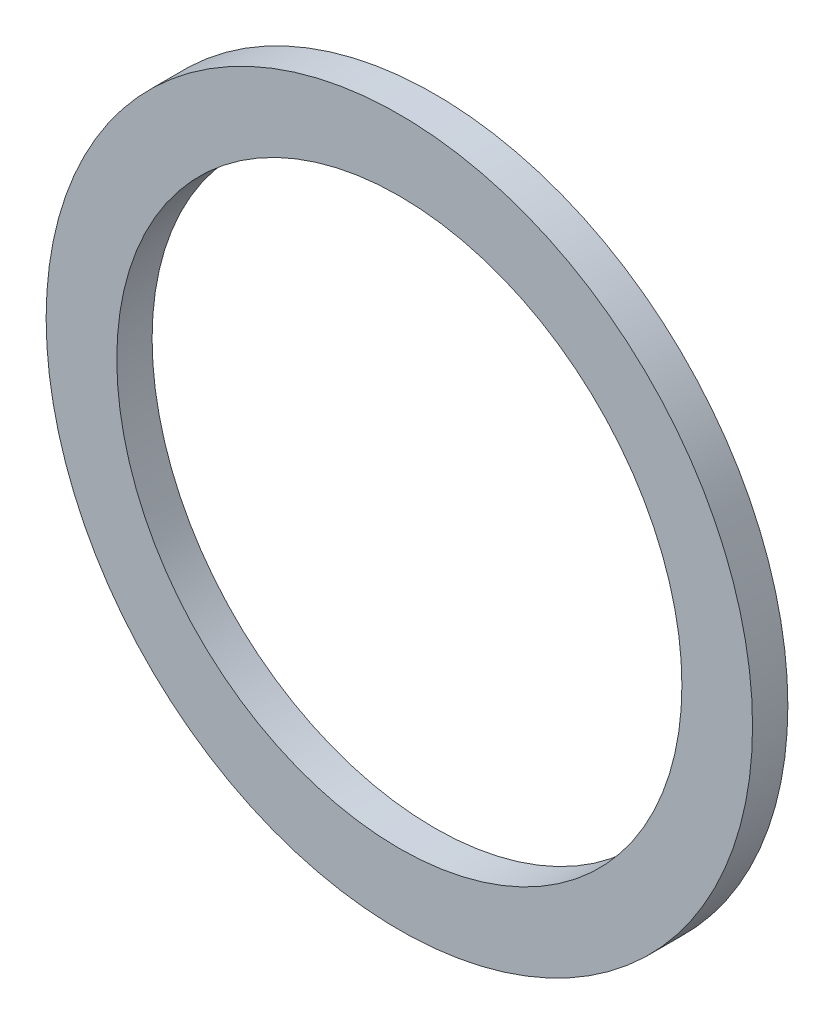
ISO-10303-21;
HEADER;
FILE_DESCRIPTION(('STEP AP214'),'2;1');
FILE_NAME('part.step','',(''),(''),'','','');
FILE_SCHEMA(('AUTOMOTIVE_DESIGN { 1 0 10303 214 1 1 1 1 }'));
ENDSEC;
DATA;
#1=APPLICATION_CONTEXT('core data for automotive mechanical design processes');
#2=APPLICATION_PROTOCOL_DEFINITION('international standard','automotive_design',2000,#1);
#3=PRODUCT_CONTEXT('',#1,'mechanical');
#4=PRODUCT('Part','Part','',(#3));
#5=PRODUCT_RELATED_PRODUCT_CATEGORY('part','',(#4));
#6=PRODUCT_DEFINITION_FORMATION('','',#4);
#7=PRODUCT_DEFINITION_CONTEXT('part definition',#1,'design');
#8=PRODUCT_DEFINITION('design','',#6,#7);
#9=PRODUCT_DEFINITION_SHAPE('','',#8);
#10=(LENGTH_UNIT() NAMED_UNIT(*) SI_UNIT(.MILLI.,.METRE.));
#11=(NAMED_UNIT(*) PLANE_ANGLE_UNIT() SI_UNIT($,.RADIAN.));
#12=(NAMED_UNIT(*) SI_UNIT($,.STERADIAN.) SOLID_ANGLE_UNIT());
#13=UNCERTAINTY_MEASURE_WITH_UNIT(LENGTH_MEASURE(1.E-05),#10,'distance_accuracy_value','');
#14=(GEOMETRIC_REPRESENTATION_CONTEXT(3) GLOBAL_UNCERTAINTY_ASSIGNED_CONTEXT((#13)) GLOBAL_UNIT_ASSIGNED_CONTEXT((#10,
#11,#12)) REPRESENTATION_CONTEXT('',''));
#15=CARTESIAN_POINT('',(0.,0.,0.));
#16=DIRECTION('',(0.,0.,1.));
#17=DIRECTION('',(1.,0.,0.));
#18=AXIS2_PLACEMENT_3D('',#15,#16,#17);
#19=CARTESIAN_POINT('',(8.00000011920929,-2.00000002980232,2.));
#20=DIRECTION('',(0.,0.,-1.));
#21=DIRECTION('',(0.,-1.,0.));
#22=AXIS2_PLACEMENT_3D('',#19,#20,#21);
#23=PLANE('',#22);
#24=CARTESIAN_POINT('',(8.00000011920929,-2.00000002980232,2.));
#25=DIRECTION('',(0.,0.,1.));
#26=DIRECTION('',(1.,0.,0.));
#27=AXIS2_PLACEMENT_3D('',#24,#25,#26);
#28=CIRCLE('',#27,0.800000014901161);
#29=CARTESIAN_POINT('',(7.20000010430813,-2.00000002980232,2.));
#30=VERTEX_POINT('',#29);
#31=EDGE_CURVE('E52',#30,#30,#28,.T.);
#32=ORIENTED_EDGE('',*,*,#31,.T.);
#33=EDGE_LOOP('',(#32));
#34=FACE_BOUND('',#33,.T.);
#35=CARTESIAN_POINT('',(8.00000011920929,-2.00000002980232,2.));
#36=DIRECTION('',(0.,0.,-1.));
#37=DIRECTION('',(1.,0.,0.));
#38=AXIS2_PLACEMENT_3D('',#35,#36,#37);
#39=CIRCLE('',#38,1.00000001490116);
#40=CARTESIAN_POINT('',(7.00000010430813,-2.00000002980232,2.));
#41=VERTEX_POINT('',#40);
#42=EDGE_CURVE('E11',#41,#41,#39,.T.);
#43=ORIENTED_EDGE('',*,*,#42,.T.);
#44=EDGE_LOOP('',(#43));
#45=FACE_BOUND('',#44,.T.);
#46=ADVANCED_FACE('F17',(#34,#45),#23,.T.);
#47=CARTESIAN_POINT('',(8.00000011920929,-2.00000002980232,2.1));
#48=DIRECTION('',(0.,0.,-1.));
#49=DIRECTION('',(0.,-1.,0.));
#50=AXIS2_PLACEMENT_3D('',#47,#48,#49);
#51=PLANE('',#50);
#52=CARTESIAN_POINT('',(8.00000011920929,-2.00000002980232,2.1));
#53=DIRECTION('',(0.,0.,1.));
#54=DIRECTION('',(1.,0.,0.));
#55=AXIS2_PLACEMENT_3D('',#52,#53,#54);
#56=CIRCLE('',#55,0.800000014901161);
#57=CARTESIAN_POINT('',(7.20000010430813,-2.00000002980232,2.1));
#58=VERTEX_POINT('',#57);
#59=EDGE_CURVE('E60',#58,#58,#56,.T.);
#60=ORIENTED_EDGE('',*,*,#59,.F.);
#61=EDGE_LOOP('',(#60));
#62=FACE_BOUND('',#61,.T.);
#63=CARTESIAN_POINT('',(8.00000011920929,-2.00000002980232,2.1));
#64=DIRECTION('',(0.,0.,-1.));
#65=DIRECTION('',(1.,0.,0.));
#66=AXIS2_PLACEMENT_3D('',#63,#64,#65);
#67=CIRCLE('',#66,1.00000001490116);
#68=CARTESIAN_POINT('',(7.00000010430813,-2.00000002980232,2.1));
#69=VERTEX_POINT('',#68);
#70=EDGE_CURVE('E20',#69,#69,#67,.T.);
#71=ORIENTED_EDGE('',*,*,#70,.F.);
#72=EDGE_LOOP('',(#71));
#73=FACE_BOUND('',#72,.T.);
#74=ADVANCED_FACE('F70',(#62,#73),#51,.F.);
#75=CARTESIAN_POINT('',(8.00000011920929,-2.00000002980232,2.));
#76=DIRECTION('',(0.,0.,-1.));
#77=DIRECTION('',(1.,0.,0.));
#78=AXIS2_PLACEMENT_3D('',#75,#76,#77);
#79=CYLINDRICAL_SURFACE('',#78,1.00000001490116);
#80=ORIENTED_EDGE('',*,*,#70,.T.);
#81=DIRECTION('',(0.,0.,-1.));
#82=VECTOR('',#81,1.);
#83=CARTESIAN_POINT('',(7.00000010430813,-2.00000002980232,2.));
#84=LINE('',#83,#82);
#85=EDGE_CURVE('E27',#69,#41,#84,.T.);
#86=ORIENTED_EDGE('',*,*,#85,.T.);
#87=ORIENTED_EDGE('',*,*,#42,.F.);
#88=ORIENTED_EDGE('',*,*,#85,.F.);
#89=EDGE_LOOP('',(#80,#86,#87,#88));
#90=FACE_BOUND('',#89,.T.);
#91=ADVANCED_FACE('F73',(#90),#79,.T.);
#92=CARTESIAN_POINT('',(8.00000011920929,-2.00000002980232,2.));
#93=DIRECTION('',(0.,0.,-1.));
#94=DIRECTION('',(1.,0.,0.));
#95=AXIS2_PLACEMENT_3D('',#92,#93,#94);
#96=CYLINDRICAL_SURFACE('',#95,0.800000014901161);
#97=ORIENTED_EDGE('',*,*,#59,.T.);
#98=DIRECTION('',(0.,0.,-1.));
#99=VECTOR('',#98,1.);
#100=CARTESIAN_POINT('',(7.20000010430813,-2.00000002980232,2.));
#101=LINE('',#100,#99);
#102=EDGE_CURVE('E47',#58,#30,#101,.T.);
#103=ORIENTED_EDGE('',*,*,#102,.T.);
#104=ORIENTED_EDGE('',*,*,#31,.F.);
#105=ORIENTED_EDGE('',*,*,#102,.F.);
#106=EDGE_LOOP('',(#97,#103,#104,#105));
#107=FACE_BOUND('',#106,.T.);
#108=ADVANCED_FACE('F68',(#107),#96,.F.);
#109=CLOSED_SHELL('',(#46,#74,#91,#108));
#110=MANIFOLD_SOLID_BREP('B1',#109);
#111=ADVANCED_BREP_SHAPE_REPRESENTATION('',(#18,#110),#14);
#112=SHAPE_DEFINITION_REPRESENTATION(#9,#111);
ENDSEC;
END-ISO-10303-21;
